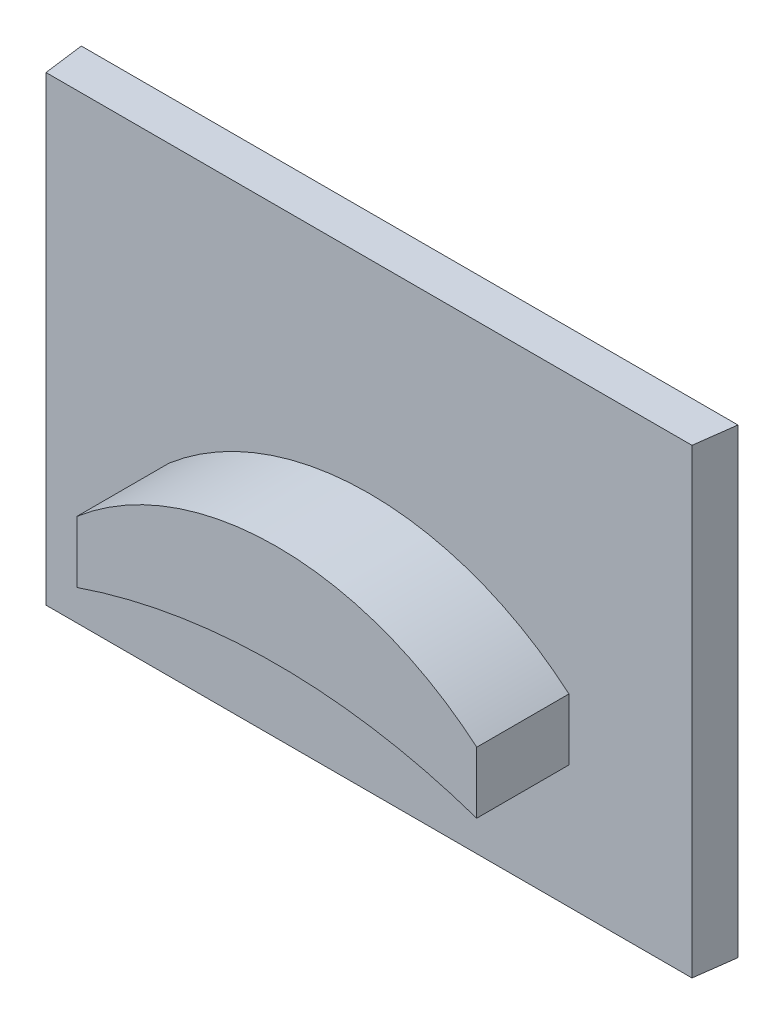
ISO-10303-21;
HEADER;
FILE_DESCRIPTION(('STEP AP214'),'2;1');
FILE_NAME('part.step','',(''),(''),'','','');
FILE_SCHEMA(('AUTOMOTIVE_DESIGN { 1 0 10303 214 1 1 1 1 }'));
ENDSEC;
DATA;
#1=APPLICATION_CONTEXT('core data for automotive mechanical design processes');
#2=APPLICATION_PROTOCOL_DEFINITION('international standard','automotive_design',2000,#1);
#3=PRODUCT_CONTEXT('',#1,'mechanical');
#4=PRODUCT('Part','Part','',(#3));
#5=PRODUCT_RELATED_PRODUCT_CATEGORY('part','',(#4));
#6=PRODUCT_DEFINITION_FORMATION('','',#4);
#7=PRODUCT_DEFINITION_CONTEXT('part definition',#1,'design');
#8=PRODUCT_DEFINITION('design','',#6,#7);
#9=PRODUCT_DEFINITION_SHAPE('','',#8);
#10=(LENGTH_UNIT() NAMED_UNIT(*) SI_UNIT(.MILLI.,.METRE.));
#11=(NAMED_UNIT(*) PLANE_ANGLE_UNIT() SI_UNIT($,.RADIAN.));
#12=(NAMED_UNIT(*) SI_UNIT($,.STERADIAN.) SOLID_ANGLE_UNIT());
#13=UNCERTAINTY_MEASURE_WITH_UNIT(LENGTH_MEASURE(1.E-05),#10,'distance_accuracy_value','');
#14=(GEOMETRIC_REPRESENTATION_CONTEXT(3) GLOBAL_UNCERTAINTY_ASSIGNED_CONTEXT((#13)) GLOBAL_UNIT_ASSIGNED_CONTEXT((#10,
#11,#12)) REPRESENTATION_CONTEXT('',''));
#15=CARTESIAN_POINT('',(0.,0.,0.));
#16=DIRECTION('',(0.,0.,1.));
#17=DIRECTION('',(1.,0.,0.));
#18=AXIS2_PLACEMENT_3D('',#15,#16,#17);
#19=CARTESIAN_POINT('',(-10.6896516233027,15.,-88.8572628568222));
#20=DIRECTION('',(0.991444861373811,0.,-0.130526192220048));
#21=DIRECTION('',(-0.130526192220048,0.,-0.991444861373811));
#22=AXIS2_PLACEMENT_3D('',#19,#20,#21);
#23=PLANE('',#22);
#24=DIRECTION('',(0.130526192220048,0.,0.991444861373811));
#25=VECTOR('',#24,1.);
#26=CARTESIAN_POINT('',(-10.6896516233027,0.,-88.8572628568222));
#27=LINE('',#26,#25);
#28=CARTESIAN_POINT('',(-10.6896516233027,0.,-88.8572628568222));
#29=VERTEX_POINT('',#28);
#30=CARTESIAN_POINT('',(-10.5158748028501,0.,-87.5372968581734));
#31=VERTEX_POINT('',#30);
#32=EDGE_CURVE('E129',#29,#31,#27,.T.);
#33=ORIENTED_EDGE('',*,*,#32,.T.);
#34=DIRECTION('',(0.,-1.,0.));
#35=VECTOR('',#34,1.);
#36=CARTESIAN_POINT('',(-10.5158748028501,15.,-87.5372968581734));
#37=LINE('',#36,#35);
#38=CARTESIAN_POINT('',(-10.5158748028501,15.,-87.5372968581734));
#39=VERTEX_POINT('',#38);
#40=EDGE_CURVE('E11',#39,#31,#37,.T.);
#41=ORIENTED_EDGE('',*,*,#40,.F.);
#42=DIRECTION('',(0.130526192220048,0.,0.991444861373811));
#43=VECTOR('',#42,1.);
#44=CARTESIAN_POINT('',(-10.6896516233027,15.,-88.8572628568222));
#45=LINE('',#44,#43);
#46=CARTESIAN_POINT('',(-10.6896516233027,15.,-88.8572628568222));
#47=VERTEX_POINT('',#46);
#48=EDGE_CURVE('E134',#47,#39,#45,.T.);
#49=ORIENTED_EDGE('',*,*,#48,.F.);
#50=DIRECTION('',(0.,-1.,0.));
#51=VECTOR('',#50,1.);
#52=CARTESIAN_POINT('',(-10.6896516233027,15.,-88.8572628568222));
#53=LINE('',#52,#51);
#54=EDGE_CURVE('E144',#47,#29,#53,.T.);
#55=ORIENTED_EDGE('',*,*,#54,.T.);
#56=EDGE_LOOP('',(#33,#41,#49,#55));
#57=FACE_BOUND('',#56,.T.);
#58=ADVANCED_FACE('F33',(#57),#23,.F.);
#59=CARTESIAN_POINT('',(-10.5158748028501,15.,-87.5372968581734));
#60=DIRECTION('',(-0.000195806638839484,0.,-0.99999998082988));
#61=DIRECTION('',(-0.99999998082988,0.,0.000195806638839484));
#62=AXIS2_PLACEMENT_3D('',#59,#60,#61);
#63=PLANE('',#62);
#64=DIRECTION('',(0.,-1.,0.));
#65=VECTOR('',#64,1.);
#66=CARTESIAN_POINT('',(-6.51587487953063,6.,-87.5380800847288));
#67=LINE('',#66,#65);
#68=CARTESIAN_POINT('',(-6.51587487953063,6.,-87.5380800847288));
#69=VERTEX_POINT('',#68);
#70=CARTESIAN_POINT('',(-6.51587487953063,4.,-87.5380800847288));
#71=VERTEX_POINT('',#70);
#72=EDGE_CURVE('E47',#69,#71,#67,.T.);
#73=ORIENTED_EDGE('',*,*,#72,.F.);
#74=CARTESIAN_POINT('',(-0.0158748028501476,-1.5993419046177,-87.5393528279207));
#75=DIRECTION('',(-0.000195806638839392,0.,-0.99999998082988));
#76=DIRECTION('',(-0.99999998082988,0.,0.000195806638839392));
#77=AXIS2_PLACEMENT_3D('',#74,#75,#76);
#78=CIRCLE('',#77,10.);
#79=CARTESIAN_POINT('',(6.48412527383033,6.,-87.5406255711126));
#80=VERTEX_POINT('',#79);
#81=EDGE_CURVE('E124',#69,#80,#78,.T.);
#82=ORIENTED_EDGE('',*,*,#81,.T.);
#83=DIRECTION('',(0.,1.,0.));
#84=VECTOR('',#83,1.);
#85=CARTESIAN_POINT('',(6.48412527383033,4.,-87.5406255711126));
#86=LINE('',#85,#84);
#87=CARTESIAN_POINT('',(6.48412527383034,4.,-87.5406255711125));
#88=VERTEX_POINT('',#87);
#89=EDGE_CURVE('E110',#88,#80,#86,.T.);
#90=ORIENTED_EDGE('',*,*,#89,.F.);
#91=CARTESIAN_POINT('',(-0.0158748028501464,-14.9142802502046,-87.5393528279207));
#92=DIRECTION('',(-0.000195806638839392,0.,-0.99999998082988));
#93=DIRECTION('',(-0.99999998082988,0.,0.000195806638839392));
#94=AXIS2_PLACEMENT_3D('',#91,#92,#93);
#95=CIRCLE('',#94,20.);
#96=EDGE_CURVE('E52',#71,#88,#95,.T.);
#97=ORIENTED_EDGE('',*,*,#96,.F.);
#98=EDGE_LOOP('',(#73,#82,#90,#97));
#99=FACE_BOUND('',#98,.T.);
#100=DIRECTION('',(0.99999998082988,0.,-0.000195806638839484));
#101=VECTOR('',#100,1.);
#102=CARTESIAN_POINT('',(-10.5158748028501,0.,-87.5372968581734));
#103=LINE('',#102,#101);
#104=CARTESIAN_POINT('',(10.4841251971499,0.,-87.5414087976679));
#105=VERTEX_POINT('',#104);
#106=EDGE_CURVE('E147',#31,#105,#103,.T.);
#107=ORIENTED_EDGE('',*,*,#106,.T.);
#108=DIRECTION('',(0.,-1.,0.));
#109=VECTOR('',#108,1.);
#110=CARTESIAN_POINT('',(10.4841251971499,15.,-87.5414087976679));
#111=LINE('',#110,#109);
#112=CARTESIAN_POINT('',(10.4841251971499,15.,-87.5414087976679));
#113=VERTEX_POINT('',#112);
#114=EDGE_CURVE('E40',#113,#105,#111,.T.);
#115=ORIENTED_EDGE('',*,*,#114,.F.);
#116=DIRECTION('',(0.99999998082988,0.,-0.000195806638839484));
#117=VECTOR('',#116,1.);
#118=CARTESIAN_POINT('',(-10.5158748028501,15.,-87.5372968581734));
#119=LINE('',#118,#117);
#120=EDGE_CURVE('E137',#39,#113,#119,.T.);
#121=ORIENTED_EDGE('',*,*,#120,.F.);
#122=ORIENTED_EDGE('',*,*,#40,.T.);
#123=EDGE_LOOP('',(#107,#115,#121,#122));
#124=FACE_BOUND('',#123,.T.);
#125=ADVANCED_FACE('F177',(#99,#124),#63,.F.);
#126=CARTESIAN_POINT('',(10.4841251971499,15.,-87.5414087976679));
#127=DIRECTION('',(-0.991444861373809,0.,-0.130526192220059));
#128=DIRECTION('',(-0.130526192220059,0.,0.99144486137381));
#129=AXIS2_PLACEMENT_3D('',#126,#127,#128);
#130=PLANE('',#129);
#131=DIRECTION('',(0.130526192220059,0.,-0.991444861373809));
#132=VECTOR('',#131,1.);
#133=CARTESIAN_POINT('',(10.4841251971499,0.,-87.5414087976679));
#134=LINE('',#133,#132);
#135=CARTESIAN_POINT('',(10.6579109772218,0.,-88.8614428513826));
#136=VERTEX_POINT('',#135);
#137=EDGE_CURVE('E149',#105,#136,#134,.T.);
#138=ORIENTED_EDGE('',*,*,#137,.T.);
#139=DIRECTION('',(0.,-1.,0.));
#140=VECTOR('',#139,1.);
#141=CARTESIAN_POINT('',(10.6579109772218,15.,-88.8614428513826));
#142=LINE('',#141,#140);
#143=CARTESIAN_POINT('',(10.6579109772218,15.,-88.8614428513826));
#144=VERTEX_POINT('',#143);
#145=EDGE_CURVE('E154',#144,#136,#142,.T.);
#146=ORIENTED_EDGE('',*,*,#145,.F.);
#147=DIRECTION('',(0.130526192220059,0.,-0.991444861373809));
#148=VECTOR('',#147,1.);
#149=CARTESIAN_POINT('',(10.4841251971499,15.,-87.5414087976679));
#150=LINE('',#149,#148);
#151=EDGE_CURVE('E140',#113,#144,#150,.T.);
#152=ORIENTED_EDGE('',*,*,#151,.F.);
#153=ORIENTED_EDGE('',*,*,#114,.T.);
#154=EDGE_LOOP('',(#138,#146,#152,#153));
#155=FACE_BOUND('',#154,.T.);
#156=ADVANCED_FACE('F161',(#155),#130,.F.);
#157=CARTESIAN_POINT('',(-10.6896516233027,15.,-88.8572628568222));
#158=DIRECTION('',(0.000195806638840901,0.,0.99999998082988));
#159=DIRECTION('',(0.99999998082988,0.,-0.000195806638840901));
#160=AXIS2_PLACEMENT_3D('',#157,#158,#159);
#161=PLANE('',#160);
#162=DIRECTION('',(-0.99999998082988,0.,0.000195806638840901));
#163=VECTOR('',#162,1.);
#164=CARTESIAN_POINT('',(-10.6896516233027,0.,-88.8572628568222));
#165=LINE('',#164,#163);
#166=EDGE_CURVE('E138',#136,#29,#165,.T.);
#167=ORIENTED_EDGE('',*,*,#166,.T.);
#168=ORIENTED_EDGE('',*,*,#54,.F.);
#169=DIRECTION('',(-0.99999998082988,0.,0.000195806638840901));
#170=VECTOR('',#169,1.);
#171=CARTESIAN_POINT('',(-10.6896516233027,15.,-88.8572628568222));
#172=LINE('',#171,#170);
#173=EDGE_CURVE('E142',#144,#47,#172,.T.);
#174=ORIENTED_EDGE('',*,*,#173,.F.);
#175=ORIENTED_EDGE('',*,*,#145,.T.);
#176=EDGE_LOOP('',(#167,#168,#174,#175));
#177=FACE_BOUND('',#176,.T.);
#178=ADVANCED_FACE('F170',(#177),#161,.F.);
#179=CARTESIAN_POINT('',(0.,15.,0.));
#180=DIRECTION('',(0.,1.,0.));
#181=DIRECTION('',(0.,0.,1.));
#182=AXIS2_PLACEMENT_3D('',#179,#180,#181);
#183=PLANE('',#182);
#184=ORIENTED_EDGE('',*,*,#48,.T.);
#185=ORIENTED_EDGE('',*,*,#120,.T.);
#186=ORIENTED_EDGE('',*,*,#151,.T.);
#187=ORIENTED_EDGE('',*,*,#173,.T.);
#188=EDGE_LOOP('',(#184,#185,#186,#187));
#189=FACE_BOUND('',#188,.T.);
#190=ADVANCED_FACE('F176',(#189),#183,.T.);
#191=CARTESIAN_POINT('',(0.,0.,0.));
#192=DIRECTION('',(0.,1.,0.));
#193=DIRECTION('',(0.,0.,1.));
#194=AXIS2_PLACEMENT_3D('',#191,#192,#193);
#195=PLANE('',#194);
#196=ORIENTED_EDGE('',*,*,#32,.F.);
#197=ORIENTED_EDGE('',*,*,#166,.F.);
#198=ORIENTED_EDGE('',*,*,#137,.F.);
#199=ORIENTED_EDGE('',*,*,#106,.F.);
#200=EDGE_LOOP('',(#196,#197,#198,#199));
#201=FACE_BOUND('',#200,.T.);
#202=ADVANCED_FACE('F167',(#201),#195,.F.);
#203=CARTESIAN_POINT('',(-0.0152873829336294,-1.5993419046177,-84.5393528854311));
#204=DIRECTION('',(-0.000195806638839392,0.,-0.99999998082988));
#205=DIRECTION('',(-0.99999998082988,0.,0.000195806638839392));
#206=AXIS2_PLACEMENT_3D('',#203,#204,#205);
#207=CYLINDRICAL_SURFACE('',#206,10.);
#208=ORIENTED_EDGE('',*,*,#81,.F.);
#209=DIRECTION('',(-0.000195806638839392,0.,-0.99999998082988));
#210=VECTOR('',#209,1.);
#211=CARTESIAN_POINT('',(-6.51528745961411,6.,-84.5380801422392));
#212=LINE('',#211,#210);
#213=CARTESIAN_POINT('',(-6.51528745961411,6.,-84.5380801422392));
#214=VERTEX_POINT('',#213);
#215=EDGE_CURVE('E117',#214,#69,#212,.T.);
#216=ORIENTED_EDGE('',*,*,#215,.F.);
#217=CARTESIAN_POINT('',(-0.0152873829336294,-1.5993419046177,-84.5393528854311));
#218=DIRECTION('',(-0.000195806638839392,0.,-0.99999998082988));
#219=DIRECTION('',(-0.99999998082988,0.,0.000195806638839392));
#220=AXIS2_PLACEMENT_3D('',#217,#218,#219);
#221=CIRCLE('',#220,10.);
#222=CARTESIAN_POINT('',(6.48471269374685,6.,-84.5406256286229));
#223=VERTEX_POINT('',#222);
#224=EDGE_CURVE('E99',#214,#223,#221,.T.);
#225=ORIENTED_EDGE('',*,*,#224,.T.);
#226=DIRECTION('',(-0.000195806638839392,0.,-0.99999998082988));
#227=VECTOR('',#226,1.);
#228=CARTESIAN_POINT('',(6.48471269374685,6.,-84.5406256286229));
#229=LINE('',#228,#227);
#230=EDGE_CURVE('E108',#223,#80,#229,.T.);
#231=ORIENTED_EDGE('',*,*,#230,.T.);
#232=EDGE_LOOP('',(#208,#216,#225,#231));
#233=FACE_BOUND('',#232,.T.);
#234=ADVANCED_FACE('F116',(#233),#207,.T.);
#235=CARTESIAN_POINT('',(-6.51528745961411,6.,-84.5380801422392));
#236=DIRECTION('',(0.99999998082988,0.,-0.000195806638839392));
#237=DIRECTION('',(-0.000195806638839392,0.,-0.99999998082988));
#238=AXIS2_PLACEMENT_3D('',#235,#236,#237);
#239=PLANE('',#238);
#240=ORIENTED_EDGE('',*,*,#72,.T.);
#241=DIRECTION('',(-0.000195806638839392,0.,-0.99999998082988));
#242=VECTOR('',#241,1.);
#243=CARTESIAN_POINT('',(-6.51528745961411,4.,-84.5380801422392));
#244=LINE('',#243,#242);
#245=CARTESIAN_POINT('',(-6.51528745961411,4.,-84.5380801422392));
#246=VERTEX_POINT('',#245);
#247=EDGE_CURVE('E130',#246,#71,#244,.T.);
#248=ORIENTED_EDGE('',*,*,#247,.F.);
#249=DIRECTION('',(0.,-1.,0.));
#250=VECTOR('',#249,1.);
#251=CARTESIAN_POINT('',(-6.51528745961411,6.,-84.5380801422392));
#252=LINE('',#251,#250);
#253=EDGE_CURVE('E114',#214,#246,#252,.T.);
#254=ORIENTED_EDGE('',*,*,#253,.F.);
#255=ORIENTED_EDGE('',*,*,#215,.T.);
#256=EDGE_LOOP('',(#240,#248,#254,#255));
#257=FACE_BOUND('',#256,.T.);
#258=ADVANCED_FACE('F193',(#257),#239,.F.);
#259=CARTESIAN_POINT('',(-0.0152873829336282,-14.9142802502046,-84.5393528854311));
#260=DIRECTION('',(-0.000195806638839392,0.,-0.99999998082988));
#261=DIRECTION('',(-0.99999998082988,0.,0.000195806638839392));
#262=AXIS2_PLACEMENT_3D('',#259,#260,#261);
#263=CYLINDRICAL_SURFACE('',#262,20.);
#264=ORIENTED_EDGE('',*,*,#96,.T.);
#265=DIRECTION('',(-0.000195806638839392,0.,-0.99999998082988));
#266=VECTOR('',#265,1.);
#267=CARTESIAN_POINT('',(6.48471269374685,4.,-84.5406256286229));
#268=LINE('',#267,#266);
#269=CARTESIAN_POINT('',(6.48471269374685,4.,-84.5406256286229));
#270=VERTEX_POINT('',#269);
#271=EDGE_CURVE('E113',#270,#88,#268,.T.);
#272=ORIENTED_EDGE('',*,*,#271,.F.);
#273=CARTESIAN_POINT('',(-0.0152873829336282,-14.9142802502046,-84.5393528854311));
#274=DIRECTION('',(-0.000195806638839392,0.,-0.99999998082988));
#275=DIRECTION('',(-0.99999998082988,0.,0.000195806638839392));
#276=AXIS2_PLACEMENT_3D('',#273,#274,#275);
#277=CIRCLE('',#276,20.);
#278=EDGE_CURVE('E101',#246,#270,#277,.T.);
#279=ORIENTED_EDGE('',*,*,#278,.F.);
#280=ORIENTED_EDGE('',*,*,#247,.T.);
#281=EDGE_LOOP('',(#264,#272,#279,#280));
#282=FACE_BOUND('',#281,.T.);
#283=ADVANCED_FACE('F196',(#282),#263,.F.);
#284=CARTESIAN_POINT('',(6.48471269374685,4.,-84.5406256286229));
#285=DIRECTION('',(-0.99999998082988,0.,0.000195806638839392));
#286=DIRECTION('',(0.000195806638839392,0.,0.99999998082988));
#287=AXIS2_PLACEMENT_3D('',#284,#285,#286);
#288=PLANE('',#287);
#289=ORIENTED_EDGE('',*,*,#89,.T.);
#290=ORIENTED_EDGE('',*,*,#230,.F.);
#291=DIRECTION('',(0.,1.,0.));
#292=VECTOR('',#291,1.);
#293=CARTESIAN_POINT('',(6.48471269374685,4.,-84.5406256286229));
#294=LINE('',#293,#292);
#295=EDGE_CURVE('E95',#270,#223,#294,.T.);
#296=ORIENTED_EDGE('',*,*,#295,.F.);
#297=ORIENTED_EDGE('',*,*,#271,.T.);
#298=EDGE_LOOP('',(#289,#290,#296,#297));
#299=FACE_BOUND('',#298,.T.);
#300=ADVANCED_FACE('F109',(#299),#288,.F.);
#301=CARTESIAN_POINT('',(-0.0152873829336294,-1.5993419046177,-84.5393528854311));
#302=DIRECTION('',(-0.000195806638839392,0.,-0.99999998082988));
#303=DIRECTION('',(-0.99999998082988,0.,0.000195806638839392));
#304=AXIS2_PLACEMENT_3D('',#301,#302,#303);
#305=PLANE('',#304);
#306=ORIENTED_EDGE('',*,*,#224,.F.);
#307=ORIENTED_EDGE('',*,*,#253,.T.);
#308=ORIENTED_EDGE('',*,*,#278,.T.);
#309=ORIENTED_EDGE('',*,*,#295,.T.);
#310=EDGE_LOOP('',(#306,#307,#308,#309));
#311=FACE_BOUND('',#310,.T.);
#312=ADVANCED_FACE('F97',(#311),#305,.F.);
#313=CLOSED_SHELL('',(#58,#125,#156,#178,#190,#202,#234,#258,#283,#300,#312));
#314=MANIFOLD_SOLID_BREP('B2',#313);
#315=ADVANCED_BREP_SHAPE_REPRESENTATION('',(#18,#314),#14);
#316=SHAPE_DEFINITION_REPRESENTATION(#9,#315);
ENDSEC;
END-ISO-10303-21;
